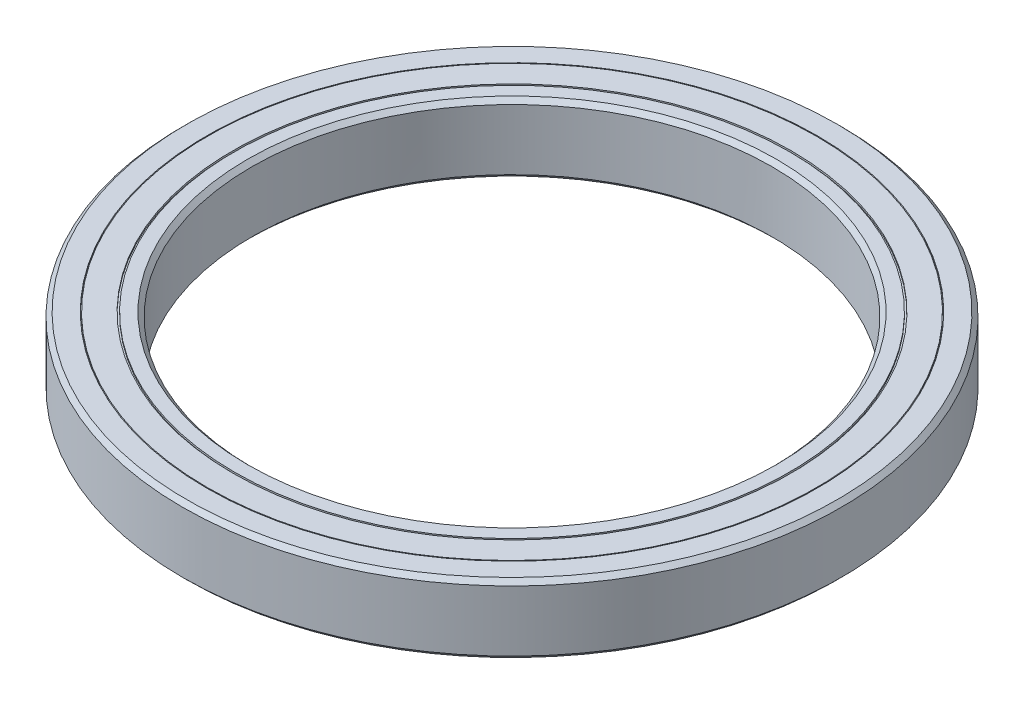
ISO-10303-21;
HEADER;
FILE_DESCRIPTION(('STEP AP214'),'2;1');
FILE_NAME('part.step','',(''),(''),'','','');
FILE_SCHEMA(('AUTOMOTIVE_DESIGN { 1 0 10303 214 1 1 1 1 }'));
ENDSEC;
DATA;
#1=APPLICATION_CONTEXT('core data for automotive mechanical design processes');
#2=APPLICATION_PROTOCOL_DEFINITION('international standard','automotive_design',2000,#1);
#3=PRODUCT_CONTEXT('',#1,'mechanical');
#4=PRODUCT('Part','Part','',(#3));
#5=PRODUCT_RELATED_PRODUCT_CATEGORY('part','',(#4));
#6=PRODUCT_DEFINITION_FORMATION('','',#4);
#7=PRODUCT_DEFINITION_CONTEXT('part definition',#1,'design');
#8=PRODUCT_DEFINITION('design','',#6,#7);
#9=PRODUCT_DEFINITION_SHAPE('','',#8);
#10=(LENGTH_UNIT() NAMED_UNIT(*) SI_UNIT(.MILLI.,.METRE.));
#11=(NAMED_UNIT(*) PLANE_ANGLE_UNIT() SI_UNIT($,.RADIAN.));
#12=(NAMED_UNIT(*) SI_UNIT($,.STERADIAN.) SOLID_ANGLE_UNIT());
#13=UNCERTAINTY_MEASURE_WITH_UNIT(LENGTH_MEASURE(1.E-05),#10,'distance_accuracy_value','');
#14=(GEOMETRIC_REPRESENTATION_CONTEXT(3) GLOBAL_UNCERTAINTY_ASSIGNED_CONTEXT((#13)) GLOBAL_UNIT_ASSIGNED_CONTEXT((#10,
#11,#12)) REPRESENTATION_CONTEXT('',''));
#15=CARTESIAN_POINT('',(0.,0.,0.));
#16=DIRECTION('',(0.,0.,1.));
#17=DIRECTION('',(1.,0.,0.));
#18=AXIS2_PLACEMENT_3D('',#15,#16,#17);
#19=CARTESIAN_POINT('',(35.1,3.79999999999999,0.));
#20=DIRECTION('',(0.,-1.,0.));
#21=DIRECTION('',(0.,0.,-1.));
#22=AXIS2_PLACEMENT_3D('',#19,#20,#21);
#23=PLANE('',#22);
#24=CARTESIAN_POINT('',(0.,3.79999999999999,0.));
#25=DIRECTION('',(0.,1.,0.));
#26=DIRECTION('',(0.,0.,1.));
#27=AXIS2_PLACEMENT_3D('',#24,#25,#26);
#28=CIRCLE('',#27,35.1);
#29=CARTESIAN_POINT('',(0.,3.79999999999999,35.1));
#30=VERTEX_POINT('',#29);
#31=EDGE_CURVE('E64',#30,#30,#28,.T.);
#32=ORIENTED_EDGE('',*,*,#31,.F.);
#33=EDGE_LOOP('',(#32));
#34=FACE_BOUND('',#33,.T.);
#35=CARTESIAN_POINT('',(0.,3.79999999999999,0.));
#36=DIRECTION('',(0.,1.,0.));
#37=DIRECTION('',(0.,0.,1.));
#38=AXIS2_PLACEMENT_3D('',#35,#36,#37);
#39=CIRCLE('',#38,35.2);
#40=CARTESIAN_POINT('',(0.,3.79999999999999,35.2));
#41=VERTEX_POINT('',#40);
#42=EDGE_CURVE('E109',#41,#41,#39,.T.);
#43=ORIENTED_EDGE('',*,*,#42,.T.);
#44=EDGE_LOOP('',(#43));
#45=FACE_BOUND('',#44,.T.);
#46=ADVANCED_FACE('F32',(#34,#45),#23,.F.);
#47=CARTESIAN_POINT('',(0.,60.4596327278157,0.));
#48=DIRECTION('',(0.,1.,0.));
#49=DIRECTION('',(0.,0.,1.));
#50=AXIS2_PLACEMENT_3D('',#47,#48,#49);
#51=CYLINDRICAL_SURFACE('',#50,35.1);
#52=CARTESIAN_POINT('',(0.,4.,0.));
#53=DIRECTION('',(0.,1.,0.));
#54=DIRECTION('',(0.,0.,1.));
#55=AXIS2_PLACEMENT_3D('',#52,#53,#54);
#56=CIRCLE('',#55,35.1);
#57=CARTESIAN_POINT('',(0.,4.,35.1));
#58=VERTEX_POINT('',#57);
#59=EDGE_CURVE('E67',#58,#58,#56,.T.);
#60=ORIENTED_EDGE('',*,*,#59,.F.);
#61=EDGE_LOOP('',(#60));
#62=FACE_BOUND('',#61,.T.);
#63=ORIENTED_EDGE('',*,*,#31,.T.);
#64=EDGE_LOOP('',(#63));
#65=FACE_BOUND('',#64,.T.);
#66=ADVANCED_FACE('F132',(#62,#65),#51,.T.);
#67=CARTESIAN_POINT('',(32.2,3.99999999999999,0.));
#68=DIRECTION('',(0.,-1.,0.));
#69=DIRECTION('',(0.,0.,-1.));
#70=AXIS2_PLACEMENT_3D('',#67,#68,#69);
#71=PLANE('',#70);
#72=CARTESIAN_POINT('',(0.,4.,0.));
#73=DIRECTION('',(0.,1.,0.));
#74=DIRECTION('',(0.,0.,1.));
#75=AXIS2_PLACEMENT_3D('',#72,#73,#74);
#76=CIRCLE('',#75,32.2);
#77=CARTESIAN_POINT('',(0.,4.,32.2));
#78=VERTEX_POINT('',#77);
#79=EDGE_CURVE('E70',#78,#78,#76,.T.);
#80=ORIENTED_EDGE('',*,*,#79,.F.);
#81=EDGE_LOOP('',(#80));
#82=FACE_BOUND('',#81,.T.);
#83=ORIENTED_EDGE('',*,*,#59,.T.);
#84=EDGE_LOOP('',(#83));
#85=FACE_BOUND('',#84,.T.);
#86=ADVANCED_FACE('F138',(#82,#85),#71,.F.);
#87=CARTESIAN_POINT('',(0.,60.4596327278157,0.));
#88=DIRECTION('',(0.,1.,0.));
#89=DIRECTION('',(0.,0.,1.));
#90=AXIS2_PLACEMENT_3D('',#87,#88,#89);
#91=CYLINDRICAL_SURFACE('',#90,32.2);
#92=CARTESIAN_POINT('',(0.,3.8,0.));
#93=DIRECTION('',(0.,1.,0.));
#94=DIRECTION('',(0.,0.,1.));
#95=AXIS2_PLACEMENT_3D('',#92,#93,#94);
#96=CIRCLE('',#95,32.2);
#97=CARTESIAN_POINT('',(0.,3.8,32.2));
#98=VERTEX_POINT('',#97);
#99=EDGE_CURVE('E73',#98,#98,#96,.T.);
#100=ORIENTED_EDGE('',*,*,#99,.F.);
#101=EDGE_LOOP('',(#100));
#102=FACE_BOUND('',#101,.T.);
#103=ORIENTED_EDGE('',*,*,#79,.T.);
#104=EDGE_LOOP('',(#103));
#105=FACE_BOUND('',#104,.T.);
#106=ADVANCED_FACE('F324',(#102,#105),#91,.F.);
#107=CARTESIAN_POINT('',(32.,3.79999999999999,0.));
#108=DIRECTION('',(0.,-1.,0.));
#109=DIRECTION('',(0.,0.,-1.));
#110=AXIS2_PLACEMENT_3D('',#107,#108,#109);
#111=PLANE('',#110);
#112=CARTESIAN_POINT('',(0.,3.79999999999999,0.));
#113=DIRECTION('',(0.,1.,0.));
#114=DIRECTION('',(0.,0.,1.));
#115=AXIS2_PLACEMENT_3D('',#112,#113,#114);
#116=CIRCLE('',#115,32.);
#117=CARTESIAN_POINT('',(0.,3.79999999999999,32.));
#118=VERTEX_POINT('',#117);
#119=EDGE_CURVE('E76',#118,#118,#116,.T.);
#120=ORIENTED_EDGE('',*,*,#119,.F.);
#121=EDGE_LOOP('',(#120));
#122=FACE_BOUND('',#121,.T.);
#123=ORIENTED_EDGE('',*,*,#99,.T.);
#124=EDGE_LOOP('',(#123));
#125=FACE_BOUND('',#124,.T.);
#126=ADVANCED_FACE('F314',(#122,#125),#111,.F.);
#127=CARTESIAN_POINT('',(0.,60.4596327278157,0.));
#128=DIRECTION('',(0.,1.,0.));
#129=DIRECTION('',(0.,0.,1.));
#130=AXIS2_PLACEMENT_3D('',#127,#128,#129);
#131=CYLINDRICAL_SURFACE('',#130,32.);
#132=CARTESIAN_POINT('',(0.,3.99999999999999,0.));
#133=DIRECTION('',(0.,1.,0.));
#134=DIRECTION('',(0.,0.,1.));
#135=AXIS2_PLACEMENT_3D('',#132,#133,#134);
#136=CIRCLE('',#135,32.);
#137=CARTESIAN_POINT('',(0.,3.99999999999999,32.));
#138=VERTEX_POINT('',#137);
#139=EDGE_CURVE('E79',#138,#138,#136,.T.);
#140=ORIENTED_EDGE('',*,*,#139,.F.);
#141=EDGE_LOOP('',(#140));
#142=FACE_BOUND('',#141,.T.);
#143=ORIENTED_EDGE('',*,*,#119,.T.);
#144=EDGE_LOOP('',(#143));
#145=FACE_BOUND('',#144,.T.);
#146=ADVANCED_FACE('F235',(#142,#145),#131,.T.);
#147=CARTESIAN_POINT('',(30.,3.99999999999999,0.));
#148=DIRECTION('',(0.,-1.,0.));
#149=DIRECTION('',(0.,0.,-1.));
#150=AXIS2_PLACEMENT_3D('',#147,#148,#149);
#151=PLANE('',#150);
#152=CARTESIAN_POINT('',(0.,3.99999999999999,0.));
#153=DIRECTION('',(0.,-1.,0.));
#154=DIRECTION('',(0.,0.,-1.));
#155=AXIS2_PLACEMENT_3D('',#152,#153,#154);
#156=CIRCLE('',#155,30.5);
#157=CARTESIAN_POINT('',(0.,3.99999999999999,-30.5));
#158=VERTEX_POINT('',#157);
#159=EDGE_CURVE('E52',#158,#158,#156,.T.);
#160=ORIENTED_EDGE('',*,*,#159,.T.);
#161=EDGE_LOOP('',(#160));
#162=FACE_BOUND('',#161,.T.);
#163=ORIENTED_EDGE('',*,*,#139,.T.);
#164=EDGE_LOOP('',(#163));
#165=FACE_BOUND('',#164,.T.);
#166=ADVANCED_FACE('F225',(#162,#165),#151,.F.);
#167=CARTESIAN_POINT('',(0.,60.4596327278157,0.));
#168=DIRECTION('',(0.,1.,0.));
#169=DIRECTION('',(0.,0.,1.));
#170=AXIS2_PLACEMENT_3D('',#167,#168,#169);
#171=CYLINDRICAL_SURFACE('',#170,30.);
#172=CARTESIAN_POINT('',(0.,-3.49999999999999,0.));
#173=DIRECTION('',(0.,1.,0.));
#174=DIRECTION('',(0.,0.,1.));
#175=AXIS2_PLACEMENT_3D('',#172,#173,#174);
#176=CIRCLE('',#175,30.);
#177=CARTESIAN_POINT('',(0.,-3.49999999999999,30.));
#178=VERTEX_POINT('',#177);
#179=EDGE_CURVE('E55',#178,#178,#176,.F.);
#180=ORIENTED_EDGE('',*,*,#179,.T.);
#181=EDGE_LOOP('',(#180));
#182=FACE_BOUND('',#181,.T.);
#183=CARTESIAN_POINT('',(0.,3.5,0.));
#184=DIRECTION('',(0.,-1.,0.));
#185=DIRECTION('',(0.,0.,-1.));
#186=AXIS2_PLACEMENT_3D('',#183,#184,#185);
#187=CIRCLE('',#186,30.);
#188=CARTESIAN_POINT('',(0.,3.5,-30.));
#189=VERTEX_POINT('',#188);
#190=EDGE_CURVE('E58',#189,#189,#187,.F.);
#191=ORIENTED_EDGE('',*,*,#190,.T.);
#192=EDGE_LOOP('',(#191));
#193=FACE_BOUND('',#192,.T.);
#194=ADVANCED_FACE('F213',(#182,#193),#171,.F.);
#195=CARTESIAN_POINT('',(30.,-4.,0.));
#196=DIRECTION('',(0.,1.,0.));
#197=DIRECTION('',(0.,0.,1.));
#198=AXIS2_PLACEMENT_3D('',#195,#196,#197);
#199=PLANE('',#198);
#200=CARTESIAN_POINT('',(0.,-4.,0.));
#201=DIRECTION('',(0.,1.,0.));
#202=DIRECTION('',(0.,0.,1.));
#203=AXIS2_PLACEMENT_3D('',#200,#201,#202);
#204=CIRCLE('',#203,30.5);
#205=CARTESIAN_POINT('',(0.,-4.,30.5));
#206=VERTEX_POINT('',#205);
#207=EDGE_CURVE('E61',#206,#206,#204,.T.);
#208=ORIENTED_EDGE('',*,*,#207,.T.);
#209=EDGE_LOOP('',(#208));
#210=FACE_BOUND('',#209,.T.);
#211=CARTESIAN_POINT('',(0.,-3.99999999999999,0.));
#212=DIRECTION('',(0.,1.,0.));
#213=DIRECTION('',(0.,0.,1.));
#214=AXIS2_PLACEMENT_3D('',#211,#212,#213);
#215=CIRCLE('',#214,32.);
#216=CARTESIAN_POINT('',(0.,-3.99999999999999,32.));
#217=VERTEX_POINT('',#216);
#218=EDGE_CURVE('E82',#217,#217,#215,.T.);
#219=ORIENTED_EDGE('',*,*,#218,.F.);
#220=EDGE_LOOP('',(#219));
#221=FACE_BOUND('',#220,.T.);
#222=ADVANCED_FACE('F207',(#210,#221),#199,.F.);
#223=CARTESIAN_POINT('',(0.,60.4596327278157,0.));
#224=DIRECTION('',(0.,1.,0.));
#225=DIRECTION('',(0.,0.,1.));
#226=AXIS2_PLACEMENT_3D('',#223,#224,#225);
#227=CYLINDRICAL_SURFACE('',#226,32.);
#228=CARTESIAN_POINT('',(0.,-3.8,0.));
#229=DIRECTION('',(0.,1.,0.));
#230=DIRECTION('',(0.,0.,1.));
#231=AXIS2_PLACEMENT_3D('',#228,#229,#230);
#232=CIRCLE('',#231,32.);
#233=CARTESIAN_POINT('',(0.,-3.8,32.));
#234=VERTEX_POINT('',#233);
#235=EDGE_CURVE('E85',#234,#234,#232,.T.);
#236=ORIENTED_EDGE('',*,*,#235,.F.);
#237=EDGE_LOOP('',(#236));
#238=FACE_BOUND('',#237,.T.);
#239=ORIENTED_EDGE('',*,*,#218,.T.);
#240=EDGE_LOOP('',(#239));
#241=FACE_BOUND('',#240,.T.);
#242=ADVANCED_FACE('F212',(#238,#241),#227,.T.);
#243=CARTESIAN_POINT('',(32.,-3.8,0.));
#244=DIRECTION('',(0.,1.,0.));
#245=DIRECTION('',(0.,0.,1.));
#246=AXIS2_PLACEMENT_3D('',#243,#244,#245);
#247=PLANE('',#246);
#248=CARTESIAN_POINT('',(0.,-3.80000000000001,0.));
#249=DIRECTION('',(0.,1.,0.));
#250=DIRECTION('',(0.,0.,1.));
#251=AXIS2_PLACEMENT_3D('',#248,#249,#250);
#252=CIRCLE('',#251,32.2);
#253=CARTESIAN_POINT('',(0.,-3.80000000000001,32.2));
#254=VERTEX_POINT('',#253);
#255=EDGE_CURVE('E88',#254,#254,#252,.T.);
#256=ORIENTED_EDGE('',*,*,#255,.F.);
#257=EDGE_LOOP('',(#256));
#258=FACE_BOUND('',#257,.T.);
#259=ORIENTED_EDGE('',*,*,#235,.T.);
#260=EDGE_LOOP('',(#259));
#261=FACE_BOUND('',#260,.T.);
#262=ADVANCED_FACE('F290',(#258,#261),#247,.F.);
#263=CARTESIAN_POINT('',(0.,60.4596327278157,0.));
#264=DIRECTION('',(0.,1.,0.));
#265=DIRECTION('',(0.,0.,1.));
#266=AXIS2_PLACEMENT_3D('',#263,#264,#265);
#267=CYLINDRICAL_SURFACE('',#266,32.2);
#268=CARTESIAN_POINT('',(0.,-4.,0.));
#269=DIRECTION('',(0.,1.,0.));
#270=DIRECTION('',(0.,0.,1.));
#271=AXIS2_PLACEMENT_3D('',#268,#269,#270);
#272=CIRCLE('',#271,32.2);
#273=CARTESIAN_POINT('',(0.,-4.,32.2));
#274=VERTEX_POINT('',#273);
#275=EDGE_CURVE('E91',#274,#274,#272,.T.);
#276=ORIENTED_EDGE('',*,*,#275,.F.);
#277=EDGE_LOOP('',(#276));
#278=FACE_BOUND('',#277,.T.);
#279=ORIENTED_EDGE('',*,*,#255,.T.);
#280=EDGE_LOOP('',(#279));
#281=FACE_BOUND('',#280,.T.);
#282=ADVANCED_FACE('F280',(#278,#281),#267,.F.);
#283=CARTESIAN_POINT('',(32.2,-4.00000000000001,0.));
#284=DIRECTION('',(0.,1.,0.));
#285=DIRECTION('',(0.,0.,1.));
#286=AXIS2_PLACEMENT_3D('',#283,#284,#285);
#287=PLANE('',#286);
#288=CARTESIAN_POINT('',(0.,-4.,0.));
#289=DIRECTION('',(0.,1.,0.));
#290=DIRECTION('',(0.,0.,1.));
#291=AXIS2_PLACEMENT_3D('',#288,#289,#290);
#292=CIRCLE('',#291,35.1);
#293=CARTESIAN_POINT('',(0.,-4.,35.1));
#294=VERTEX_POINT('',#293);
#295=EDGE_CURVE('E94',#294,#294,#292,.T.);
#296=ORIENTED_EDGE('',*,*,#295,.F.);
#297=EDGE_LOOP('',(#296));
#298=FACE_BOUND('',#297,.T.);
#299=ORIENTED_EDGE('',*,*,#275,.T.);
#300=EDGE_LOOP('',(#299));
#301=FACE_BOUND('',#300,.T.);
#302=ADVANCED_FACE('F270',(#298,#301),#287,.F.);
#303=CARTESIAN_POINT('',(0.,60.4596327278157,0.));
#304=DIRECTION('',(0.,1.,0.));
#305=DIRECTION('',(0.,0.,1.));
#306=AXIS2_PLACEMENT_3D('',#303,#304,#305);
#307=CYLINDRICAL_SURFACE('',#306,35.1);
#308=CARTESIAN_POINT('',(0.,-3.80000000000001,0.));
#309=DIRECTION('',(0.,1.,0.));
#310=DIRECTION('',(0.,0.,1.));
#311=AXIS2_PLACEMENT_3D('',#308,#309,#310);
#312=CIRCLE('',#311,35.1);
#313=CARTESIAN_POINT('',(0.,-3.80000000000001,35.1));
#314=VERTEX_POINT('',#313);
#315=EDGE_CURVE('E97',#314,#314,#312,.T.);
#316=ORIENTED_EDGE('',*,*,#315,.F.);
#317=EDGE_LOOP('',(#316));
#318=FACE_BOUND('',#317,.T.);
#319=ORIENTED_EDGE('',*,*,#295,.T.);
#320=EDGE_LOOP('',(#319));
#321=FACE_BOUND('',#320,.T.);
#322=ADVANCED_FACE('F260',(#318,#321),#307,.T.);
#323=CARTESIAN_POINT('',(35.1,-3.80000000000001,0.));
#324=DIRECTION('',(0.,1.,0.));
#325=DIRECTION('',(0.,0.,1.));
#326=AXIS2_PLACEMENT_3D('',#323,#324,#325);
#327=PLANE('',#326);
#328=CARTESIAN_POINT('',(0.,-3.80000000000001,0.));
#329=DIRECTION('',(0.,1.,0.));
#330=DIRECTION('',(0.,0.,1.));
#331=AXIS2_PLACEMENT_3D('',#328,#329,#330);
#332=CIRCLE('',#331,35.2);
#333=CARTESIAN_POINT('',(0.,-3.80000000000001,35.2));
#334=VERTEX_POINT('',#333);
#335=EDGE_CURVE('E100',#334,#334,#332,.T.);
#336=ORIENTED_EDGE('',*,*,#335,.F.);
#337=EDGE_LOOP('',(#336));
#338=FACE_BOUND('',#337,.T.);
#339=ORIENTED_EDGE('',*,*,#315,.T.);
#340=EDGE_LOOP('',(#339));
#341=FACE_BOUND('',#340,.T.);
#342=ADVANCED_FACE('F250',(#338,#341),#327,.F.);
#343=CARTESIAN_POINT('',(0.,60.4596327278157,0.));
#344=DIRECTION('',(0.,1.,0.));
#345=DIRECTION('',(0.,0.,1.));
#346=AXIS2_PLACEMENT_3D('',#343,#344,#345);
#347=CYLINDRICAL_SURFACE('',#346,35.2);
#348=CARTESIAN_POINT('',(0.,-4.,0.));
#349=DIRECTION('',(0.,1.,0.));
#350=DIRECTION('',(0.,0.,1.));
#351=AXIS2_PLACEMENT_3D('',#348,#349,#350);
#352=CIRCLE('',#351,35.2);
#353=CARTESIAN_POINT('',(0.,-4.,35.2));
#354=VERTEX_POINT('',#353);
#355=EDGE_CURVE('E103',#354,#354,#352,.T.);
#356=ORIENTED_EDGE('',*,*,#355,.F.);
#357=EDGE_LOOP('',(#356));
#358=FACE_BOUND('',#357,.T.);
#359=ORIENTED_EDGE('',*,*,#335,.T.);
#360=EDGE_LOOP('',(#359));
#361=FACE_BOUND('',#360,.T.);
#362=ADVANCED_FACE('F200',(#358,#361),#347,.F.);
#363=CARTESIAN_POINT('',(35.2,-4.00000000000001,0.));
#364=DIRECTION('',(0.,1.,0.));
#365=DIRECTION('',(0.,0.,1.));
#366=AXIS2_PLACEMENT_3D('',#363,#364,#365);
#367=PLANE('',#366);
#368=CARTESIAN_POINT('',(0.,-4.00000000000001,0.));
#369=DIRECTION('',(0.,1.,0.));
#370=DIRECTION('',(0.,0.,1.));
#371=AXIS2_PLACEMENT_3D('',#368,#369,#370);
#372=CIRCLE('',#371,37.5);
#373=CARTESIAN_POINT('',(0.,-4.00000000000001,37.5));
#374=VERTEX_POINT('',#373);
#375=EDGE_CURVE('E39',#374,#374,#372,.F.);
#376=ORIENTED_EDGE('',*,*,#375,.T.);
#377=EDGE_LOOP('',(#376));
#378=FACE_BOUND('',#377,.T.);
#379=ORIENTED_EDGE('',*,*,#355,.T.);
#380=EDGE_LOOP('',(#379));
#381=FACE_BOUND('',#380,.T.);
#382=ADVANCED_FACE('F128',(#378,#381),#367,.F.);
#383=CARTESIAN_POINT('',(0.,60.4596327278157,0.));
#384=DIRECTION('',(0.,1.,0.));
#385=DIRECTION('',(0.,0.,1.));
#386=AXIS2_PLACEMENT_3D('',#383,#384,#385);
#387=CYLINDRICAL_SURFACE('',#386,38.);
#388=CARTESIAN_POINT('',(0.,-3.5,0.));
#389=DIRECTION('',(0.,1.,0.));
#390=DIRECTION('',(0.,0.,1.));
#391=AXIS2_PLACEMENT_3D('',#388,#389,#390);
#392=CIRCLE('',#391,38.);
#393=CARTESIAN_POINT('',(0.,-3.5,38.));
#394=VERTEX_POINT('',#393);
#395=EDGE_CURVE('E43',#394,#394,#392,.T.);
#396=ORIENTED_EDGE('',*,*,#395,.T.);
#397=EDGE_LOOP('',(#396));
#398=FACE_BOUND('',#397,.T.);
#399=CARTESIAN_POINT('',(0.,3.5,0.));
#400=DIRECTION('',(0.,-1.,0.));
#401=DIRECTION('',(0.,0.,-1.));
#402=AXIS2_PLACEMENT_3D('',#399,#400,#401);
#403=CIRCLE('',#402,38.);
#404=CARTESIAN_POINT('',(0.,3.5,-38.));
#405=VERTEX_POINT('',#404);
#406=EDGE_CURVE('E47',#405,#405,#403,.T.);
#407=ORIENTED_EDGE('',*,*,#406,.T.);
#408=EDGE_LOOP('',(#407));
#409=FACE_BOUND('',#408,.T.);
#410=ADVANCED_FACE('F123',(#398,#409),#387,.T.);
#411=CARTESIAN_POINT('',(35.2,3.99999999999999,0.));
#412=DIRECTION('',(0.,-1.,0.));
#413=DIRECTION('',(0.,0.,-1.));
#414=AXIS2_PLACEMENT_3D('',#411,#412,#413);
#415=PLANE('',#414);
#416=CARTESIAN_POINT('',(0.,3.99999999999999,0.));
#417=DIRECTION('',(0.,-1.,0.));
#418=DIRECTION('',(0.,0.,-1.));
#419=AXIS2_PLACEMENT_3D('',#416,#417,#418);
#420=CIRCLE('',#419,37.5);
#421=CARTESIAN_POINT('',(0.,3.99999999999999,-37.5));
#422=VERTEX_POINT('',#421);
#423=EDGE_CURVE('E10',#422,#422,#420,.F.);
#424=ORIENTED_EDGE('',*,*,#423,.T.);
#425=EDGE_LOOP('',(#424));
#426=FACE_BOUND('',#425,.T.);
#427=CARTESIAN_POINT('',(0.,4.,0.));
#428=DIRECTION('',(0.,1.,0.));
#429=DIRECTION('',(0.,0.,1.));
#430=AXIS2_PLACEMENT_3D('',#427,#428,#429);
#431=CIRCLE('',#430,35.2);
#432=CARTESIAN_POINT('',(0.,4.,35.2));
#433=VERTEX_POINT('',#432);
#434=EDGE_CURVE('E106',#433,#433,#431,.T.);
#435=ORIENTED_EDGE('',*,*,#434,.F.);
#436=EDGE_LOOP('',(#435));
#437=FACE_BOUND('',#436,.T.);
#438=ADVANCED_FACE('F118',(#426,#437),#415,.F.);
#439=CARTESIAN_POINT('',(0.,60.4596327278157,0.));
#440=DIRECTION('',(0.,1.,0.));
#441=DIRECTION('',(0.,0.,1.));
#442=AXIS2_PLACEMENT_3D('',#439,#440,#441);
#443=CYLINDRICAL_SURFACE('',#442,35.2);
#444=ORIENTED_EDGE('',*,*,#42,.F.);
#445=EDGE_LOOP('',(#444));
#446=FACE_BOUND('',#445,.T.);
#447=ORIENTED_EDGE('',*,*,#434,.T.);
#448=EDGE_LOOP('',(#447));
#449=FACE_BOUND('',#448,.T.);
#450=ADVANCED_FACE('F114',(#446,#449),#443,.F.);
#451=CARTESIAN_POINT('',(0.,-4.,0.));
#452=DIRECTION('',(0.,-1.,0.));
#453=DIRECTION('',(0.,0.,-1.));
#454=AXIS2_PLACEMENT_3D('',#451,#452,#453);
#455=CONICAL_SURFACE('',#454,30.5,0.785398163397441);
#456=ORIENTED_EDGE('',*,*,#179,.F.);
#457=EDGE_LOOP('',(#456));
#458=FACE_BOUND('',#457,.T.);
#459=ORIENTED_EDGE('',*,*,#207,.F.);
#460=EDGE_LOOP('',(#459));
#461=FACE_BOUND('',#460,.T.);
#462=ADVANCED_FACE('F117',(#458,#461),#455,.F.);
#463=CARTESIAN_POINT('',(0.,3.5,0.));
#464=DIRECTION('',(0.,1.,0.));
#465=DIRECTION('',(0.,0.,1.));
#466=AXIS2_PLACEMENT_3D('',#463,#464,#465);
#467=CONICAL_SURFACE('',#466,30.,0.785398163397455);
#468=ORIENTED_EDGE('',*,*,#159,.F.);
#469=EDGE_LOOP('',(#468));
#470=FACE_BOUND('',#469,.T.);
#471=ORIENTED_EDGE('',*,*,#190,.F.);
#472=EDGE_LOOP('',(#471));
#473=FACE_BOUND('',#472,.T.);
#474=ADVANCED_FACE('F146',(#470,#473),#467,.F.);
#475=CARTESIAN_POINT('',(0.,-3.5,0.));
#476=DIRECTION('',(0.,1.,0.));
#477=DIRECTION('',(0.,0.,1.));
#478=AXIS2_PLACEMENT_3D('',#475,#476,#477);
#479=CONICAL_SURFACE('',#478,38.,0.785398163397455);
#480=ORIENTED_EDGE('',*,*,#375,.F.);
#481=EDGE_LOOP('',(#480));
#482=FACE_BOUND('',#481,.T.);
#483=ORIENTED_EDGE('',*,*,#395,.F.);
#484=EDGE_LOOP('',(#483));
#485=FACE_BOUND('',#484,.T.);
#486=ADVANCED_FACE('F149',(#482,#485),#479,.T.);
#487=CARTESIAN_POINT('',(0.,3.99999999999999,0.));
#488=DIRECTION('',(0.,-1.,0.));
#489=DIRECTION('',(0.,0.,-1.));
#490=AXIS2_PLACEMENT_3D('',#487,#488,#489);
#491=CONICAL_SURFACE('',#490,37.5,0.785398163397462);
#492=ORIENTED_EDGE('',*,*,#406,.F.);
#493=EDGE_LOOP('',(#492));
#494=FACE_BOUND('',#493,.T.);
#495=ORIENTED_EDGE('',*,*,#423,.F.);
#496=EDGE_LOOP('',(#495));
#497=FACE_BOUND('',#496,.T.);
#498=ADVANCED_FACE('F34',(#494,#497),#491,.T.);
#499=CLOSED_SHELL('',(#46,#66,#86,#106,#126,#146,#166,#194,#222,#242,#262,#282,#302,#322,#342,
#362,#382,#410,#438,#450,#462,#474,#486,#498));
#500=MANIFOLD_SOLID_BREP('B2',#499);
#501=ADVANCED_BREP_SHAPE_REPRESENTATION('',(#18,#500),#14);
#502=SHAPE_DEFINITION_REPRESENTATION(#9,#501);
ENDSEC;
END-ISO-10303-21;
